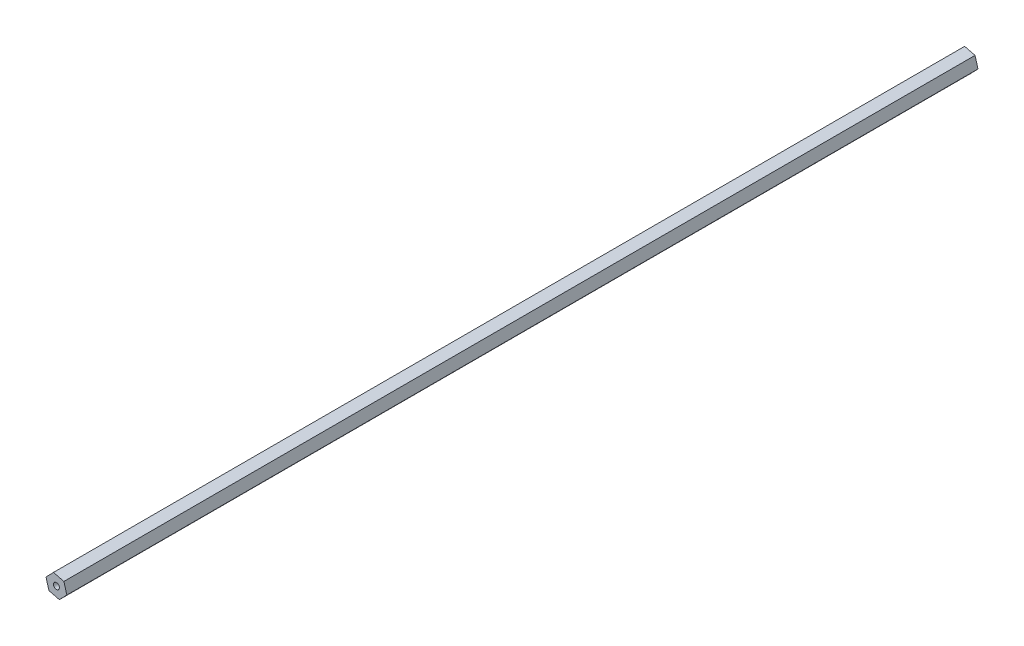
ISO-10303-21;
HEADER;
FILE_DESCRIPTION(('STEP AP214'),'2;1');
FILE_NAME('part.step','',(''),(''),'','','');
FILE_SCHEMA(('AUTOMOTIVE_DESIGN { 1 0 10303 214 1 1 1 1 }'));
ENDSEC;
DATA;
#1=APPLICATION_CONTEXT('core data for automotive mechanical design processes');
#2=APPLICATION_PROTOCOL_DEFINITION('international standard','automotive_design',2000,#1);
#3=PRODUCT_CONTEXT('',#1,'mechanical');
#4=PRODUCT('Part','Part','',(#3));
#5=PRODUCT_RELATED_PRODUCT_CATEGORY('part','',(#4));
#6=PRODUCT_DEFINITION_FORMATION('','',#4);
#7=PRODUCT_DEFINITION_CONTEXT('part definition',#1,'design');
#8=PRODUCT_DEFINITION('design','',#6,#7);
#9=PRODUCT_DEFINITION_SHAPE('','',#8);
#10=(LENGTH_UNIT() NAMED_UNIT(*) SI_UNIT(.MILLI.,.METRE.));
#11=(NAMED_UNIT(*) PLANE_ANGLE_UNIT() SI_UNIT($,.RADIAN.));
#12=(NAMED_UNIT(*) SI_UNIT($,.STERADIAN.) SOLID_ANGLE_UNIT());
#13=UNCERTAINTY_MEASURE_WITH_UNIT(LENGTH_MEASURE(1.E-05),#10,'distance_accuracy_value','');
#14=(GEOMETRIC_REPRESENTATION_CONTEXT(3) GLOBAL_UNCERTAINTY_ASSIGNED_CONTEXT((#13)) GLOBAL_UNIT_ASSIGNED_CONTEXT((#10,
#11,#12)) REPRESENTATION_CONTEXT('',''));
#15=CARTESIAN_POINT('',(0.,0.,0.));
#16=DIRECTION('',(0.,0.,1.));
#17=DIRECTION('',(1.,0.,0.));
#18=AXIS2_PLACEMENT_3D('',#15,#16,#17);
#19=CARTESIAN_POINT('',(-2.01661019445048,7.04958272928063,622.046));
#20=DIRECTION('',(0.718900237898645,-0.695113262676862,0.));
#21=DIRECTION('',(0.695113262676862,0.718900237898645,0.));
#22=AXIS2_PLACEMENT_3D('',#19,#20,#21);
#23=PLANE('',#22);
#24=DIRECTION('',(-0.695113262676862,-0.718900237898645,0.));
#25=VECTOR('',#24,1.);
#26=CARTESIAN_POINT('',(-2.01661019445048,7.04958272928063,0.));
#27=LINE('',#26,#25);
#28=CARTESIAN_POINT('',(-2.01661019445048,7.04958272928063,0.));
#29=VERTEX_POINT('',#28);
#30=CARTESIAN_POINT('',(-7.1134228268623,1.77835570671552,0.));
#31=VERTEX_POINT('',#30);
#32=EDGE_CURVE('E119',#29,#31,#27,.T.);
#33=ORIENTED_EDGE('',*,*,#32,.T.);
#34=DIRECTION('',(0.,0.,-1.));
#35=VECTOR('',#34,1.);
#36=CARTESIAN_POINT('',(-7.1134228268623,1.77835570671552,622.046));
#37=LINE('',#36,#35);
#38=CARTESIAN_POINT('',(-7.1134228268623,1.77835570671552,622.046));
#39=VERTEX_POINT('',#38);
#40=EDGE_CURVE('E11',#39,#31,#37,.T.);
#41=ORIENTED_EDGE('',*,*,#40,.F.);
#42=DIRECTION('',(-0.695113262676862,-0.718900237898645,0.));
#43=VECTOR('',#42,1.);
#44=CARTESIAN_POINT('',(-2.01661019445048,7.04958272928063,622.046));
#45=LINE('',#44,#43);
#46=CARTESIAN_POINT('',(-2.01661019445048,7.04958272928063,622.046));
#47=VERTEX_POINT('',#46);
#48=EDGE_CURVE('E129',#47,#39,#45,.T.);
#49=ORIENTED_EDGE('',*,*,#48,.F.);
#50=DIRECTION('',(0.,0.,-1.));
#51=VECTOR('',#50,1.);
#52=CARTESIAN_POINT('',(-2.01661019445048,7.04958272928063,622.046));
#53=LINE('',#52,#51);
#54=EDGE_CURVE('E115',#47,#29,#53,.T.);
#55=ORIENTED_EDGE('',*,*,#54,.T.);
#56=EDGE_LOOP('',(#33,#41,#49,#55));
#57=FACE_BOUND('',#56,.T.);
#58=ADVANCED_FACE('F34',(#57),#23,.F.);
#59=CARTESIAN_POINT('',(-7.1134228268623,1.77835570671552,622.046));
#60=DIRECTION('',(0.96143586293497,0.275029237468472,0.));
#61=DIRECTION('',(-0.275029237468472,0.96143586293497,0.));
#62=AXIS2_PLACEMENT_3D('',#59,#60,#61);
#63=PLANE('',#62);
#64=DIRECTION('',(0.275029237468472,-0.96143586293497,0.));
#65=VECTOR('',#64,1.);
#66=CARTESIAN_POINT('',(-7.1134228268623,1.77835570671552,0.));
#67=LINE('',#66,#65);
#68=CARTESIAN_POINT('',(-5.09681263241182,-5.27122702256511,0.));
#69=VERTEX_POINT('',#68);
#70=EDGE_CURVE('E122',#31,#69,#67,.T.);
#71=ORIENTED_EDGE('',*,*,#70,.T.);
#72=DIRECTION('',(0.,0.,-1.));
#73=VECTOR('',#72,1.);
#74=CARTESIAN_POINT('',(-5.09681263241182,-5.27122702256511,622.046));
#75=LINE('',#74,#73);
#76=CARTESIAN_POINT('',(-5.09681263241182,-5.27122702256511,622.046));
#77=VERTEX_POINT('',#76);
#78=EDGE_CURVE('E43',#77,#69,#75,.T.);
#79=ORIENTED_EDGE('',*,*,#78,.F.);
#80=DIRECTION('',(0.275029237468472,-0.96143586293497,0.));
#81=VECTOR('',#80,1.);
#82=CARTESIAN_POINT('',(-7.1134228268623,1.77835570671552,622.046));
#83=LINE('',#82,#81);
#84=EDGE_CURVE('E88',#39,#77,#83,.T.);
#85=ORIENTED_EDGE('',*,*,#84,.F.);
#86=ORIENTED_EDGE('',*,*,#40,.T.);
#87=EDGE_LOOP('',(#71,#79,#85,#86));
#88=FACE_BOUND('',#87,.T.);
#89=ADVANCED_FACE('F155',(#88),#63,.F.);
#90=CARTESIAN_POINT('',(-5.09681263241182,-5.27122702256511,622.046));
#91=DIRECTION('',(0.242535625036325,0.970142500145334,0.));
#92=DIRECTION('',(-0.970142500145334,0.242535625036325,0.));
#93=AXIS2_PLACEMENT_3D('',#90,#91,#92);
#94=PLANE('',#93);
#95=DIRECTION('',(0.970142500145334,-0.242535625036325,0.));
#96=VECTOR('',#95,1.);
#97=CARTESIAN_POINT('',(-5.09681263241182,-5.27122702256511,0.));
#98=LINE('',#97,#96);
#99=CARTESIAN_POINT('',(2.01661019445049,-7.04958272928063,0.));
#100=VERTEX_POINT('',#99);
#101=EDGE_CURVE('E124',#69,#100,#98,.T.);
#102=ORIENTED_EDGE('',*,*,#101,.T.);
#103=DIRECTION('',(0.,0.,-1.));
#104=VECTOR('',#103,1.);
#105=CARTESIAN_POINT('',(2.01661019445049,-7.04958272928063,622.046));
#106=LINE('',#105,#104);
#107=CARTESIAN_POINT('',(2.01661019445049,-7.04958272928063,622.046));
#108=VERTEX_POINT('',#107);
#109=EDGE_CURVE('E110',#108,#100,#106,.T.);
#110=ORIENTED_EDGE('',*,*,#109,.F.);
#111=DIRECTION('',(0.970142500145334,-0.242535625036325,0.));
#112=VECTOR('',#111,1.);
#113=CARTESIAN_POINT('',(-5.09681263241182,-5.27122702256511,622.046));
#114=LINE('',#113,#112);
#115=EDGE_CURVE('E101',#77,#108,#114,.T.);
#116=ORIENTED_EDGE('',*,*,#115,.F.);
#117=ORIENTED_EDGE('',*,*,#78,.T.);
#118=EDGE_LOOP('',(#102,#110,#116,#117));
#119=FACE_BOUND('',#118,.T.);
#120=ADVANCED_FACE('F136',(#119),#94,.F.);
#121=CARTESIAN_POINT('',(2.01661019445049,-7.04958272928063,622.046));
#122=DIRECTION('',(-0.718900237898645,0.695113262676862,0.));
#123=DIRECTION('',(-0.695113262676862,-0.718900237898645,0.));
#124=AXIS2_PLACEMENT_3D('',#121,#122,#123);
#125=PLANE('',#124);
#126=DIRECTION('',(0.695113262676862,0.718900237898645,0.));
#127=VECTOR('',#126,1.);
#128=CARTESIAN_POINT('',(2.01661019445049,-7.04958272928063,0.));
#129=LINE('',#128,#127);
#130=CARTESIAN_POINT('',(7.1134228268623,-1.77835570671552,0.));
#131=VERTEX_POINT('',#130);
#132=EDGE_CURVE('E109',#100,#131,#129,.T.);
#133=ORIENTED_EDGE('',*,*,#132,.T.);
#134=DIRECTION('',(0.,0.,-1.));
#135=VECTOR('',#134,1.);
#136=CARTESIAN_POINT('',(7.1134228268623,-1.77835570671552,622.046));
#137=LINE('',#136,#135);
#138=CARTESIAN_POINT('',(7.1134228268623,-1.77835570671552,622.046));
#139=VERTEX_POINT('',#138);
#140=EDGE_CURVE('E106',#139,#131,#137,.T.);
#141=ORIENTED_EDGE('',*,*,#140,.F.);
#142=DIRECTION('',(0.695113262676862,0.718900237898645,0.));
#143=VECTOR('',#142,1.);
#144=CARTESIAN_POINT('',(2.01661019445049,-7.04958272928063,622.046));
#145=LINE('',#144,#143);
#146=EDGE_CURVE('E95',#108,#139,#145,.T.);
#147=ORIENTED_EDGE('',*,*,#146,.F.);
#148=ORIENTED_EDGE('',*,*,#109,.T.);
#149=EDGE_LOOP('',(#133,#141,#147,#148));
#150=FACE_BOUND('',#149,.T.);
#151=ADVANCED_FACE('F107',(#150),#125,.F.);
#152=CARTESIAN_POINT('',(7.1134228268623,-1.77835570671552,622.046));
#153=DIRECTION('',(-0.96143586293497,-0.275029237468472,0.));
#154=DIRECTION('',(0.275029237468472,-0.96143586293497,0.));
#155=AXIS2_PLACEMENT_3D('',#152,#153,#154);
#156=PLANE('',#155);
#157=DIRECTION('',(-0.275029237468472,0.96143586293497,0.));
#158=VECTOR('',#157,1.);
#159=CARTESIAN_POINT('',(7.1134228268623,-1.77835570671552,0.));
#160=LINE('',#159,#158);
#161=CARTESIAN_POINT('',(5.09681263241182,5.27122702256512,0.));
#162=VERTEX_POINT('',#161);
#163=EDGE_CURVE('E74',#131,#162,#160,.T.);
#164=ORIENTED_EDGE('',*,*,#163,.T.);
#165=DIRECTION('',(0.,0.,-1.));
#166=VECTOR('',#165,1.);
#167=CARTESIAN_POINT('',(5.09681263241182,5.27122702256512,622.046));
#168=LINE('',#167,#166);
#169=CARTESIAN_POINT('',(5.09681263241182,5.27122702256512,622.046));
#170=VERTEX_POINT('',#169);
#171=EDGE_CURVE('E111',#170,#162,#168,.T.);
#172=ORIENTED_EDGE('',*,*,#171,.F.);
#173=DIRECTION('',(-0.275029237468472,0.96143586293497,0.));
#174=VECTOR('',#173,1.);
#175=CARTESIAN_POINT('',(7.1134228268623,-1.77835570671552,622.046));
#176=LINE('',#175,#174);
#177=EDGE_CURVE('E99',#139,#170,#176,.T.);
#178=ORIENTED_EDGE('',*,*,#177,.F.);
#179=ORIENTED_EDGE('',*,*,#140,.T.);
#180=EDGE_LOOP('',(#164,#172,#178,#179));
#181=FACE_BOUND('',#180,.T.);
#182=ADVANCED_FACE('F113',(#181),#156,.F.);
#183=CARTESIAN_POINT('',(5.09681263241182,5.27122702256512,622.046));
#184=DIRECTION('',(-0.242535625036325,-0.970142500145334,0.));
#185=DIRECTION('',(0.970142500145334,-0.242535625036325,0.));
#186=AXIS2_PLACEMENT_3D('',#183,#184,#185);
#187=PLANE('',#186);
#188=DIRECTION('',(-0.970142500145334,0.242535625036325,0.));
#189=VECTOR('',#188,1.);
#190=CARTESIAN_POINT('',(5.09681263241182,5.27122702256512,0.));
#191=LINE('',#190,#189);
#192=EDGE_CURVE('E80',#162,#29,#191,.T.);
#193=ORIENTED_EDGE('',*,*,#192,.T.);
#194=ORIENTED_EDGE('',*,*,#54,.F.);
#195=DIRECTION('',(-0.970142500145334,0.242535625036325,0.));
#196=VECTOR('',#195,1.);
#197=CARTESIAN_POINT('',(5.09681263241182,5.27122702256512,622.046));
#198=LINE('',#197,#196);
#199=EDGE_CURVE('E51',#170,#47,#198,.T.);
#200=ORIENTED_EDGE('',*,*,#199,.F.);
#201=ORIENTED_EDGE('',*,*,#171,.T.);
#202=EDGE_LOOP('',(#193,#194,#200,#201));
#203=FACE_BOUND('',#202,.T.);
#204=ADVANCED_FACE('F143',(#203),#187,.F.);
#205=CARTESIAN_POINT('',(0.,0.,622.046));
#206=DIRECTION('',(0.,0.,1.));
#207=DIRECTION('',(1.,0.,0.));
#208=AXIS2_PLACEMENT_3D('',#205,#206,#207);
#209=PLANE('',#208);
#210=CARTESIAN_POINT('',(0.,0.,622.046));
#211=DIRECTION('',(0.,0.,1.));
#212=DIRECTION('',(1.,0.,0.));
#213=AXIS2_PLACEMENT_3D('',#210,#211,#212);
#214=CIRCLE('',#213,2.032);
#215=CARTESIAN_POINT('',(2.032,0.,622.046));
#216=VERTEX_POINT('',#215);
#217=EDGE_CURVE('E208',#216,#216,#214,.T.);
#218=ORIENTED_EDGE('',*,*,#217,.F.);
#219=EDGE_LOOP('',(#218));
#220=FACE_BOUND('',#219,.T.);
#221=ORIENTED_EDGE('',*,*,#48,.T.);
#222=ORIENTED_EDGE('',*,*,#84,.T.);
#223=ORIENTED_EDGE('',*,*,#115,.T.);
#224=ORIENTED_EDGE('',*,*,#146,.T.);
#225=ORIENTED_EDGE('',*,*,#177,.T.);
#226=ORIENTED_EDGE('',*,*,#199,.T.);
#227=EDGE_LOOP('',(#221,#222,#223,#224,#225,#226));
#228=FACE_BOUND('',#227,.T.);
#229=ADVANCED_FACE('F97',(#220,#228),#209,.T.);
#230=CARTESIAN_POINT('',(0.,0.,0.));
#231=DIRECTION('',(0.,0.,1.));
#232=DIRECTION('',(1.,0.,0.));
#233=AXIS2_PLACEMENT_3D('',#230,#231,#232);
#234=PLANE('',#233);
#235=CARTESIAN_POINT('',(0.,0.,0.));
#236=DIRECTION('',(0.,0.,1.));
#237=DIRECTION('',(1.,0.,0.));
#238=AXIS2_PLACEMENT_3D('',#235,#236,#237);
#239=CIRCLE('',#238,2.032);
#240=CARTESIAN_POINT('',(2.032,0.,0.));
#241=VERTEX_POINT('',#240);
#242=EDGE_CURVE('E37',#241,#241,#239,.T.);
#243=ORIENTED_EDGE('',*,*,#242,.T.);
#244=EDGE_LOOP('',(#243));
#245=FACE_BOUND('',#244,.T.);
#246=ORIENTED_EDGE('',*,*,#32,.F.);
#247=ORIENTED_EDGE('',*,*,#192,.F.);
#248=ORIENTED_EDGE('',*,*,#163,.F.);
#249=ORIENTED_EDGE('',*,*,#132,.F.);
#250=ORIENTED_EDGE('',*,*,#101,.F.);
#251=ORIENTED_EDGE('',*,*,#70,.F.);
#252=EDGE_LOOP('',(#246,#247,#248,#249,#250,#251));
#253=FACE_BOUND('',#252,.T.);
#254=ADVANCED_FACE('F139',(#245,#253),#234,.F.);
#255=CARTESIAN_POINT('',(0.,0.,-114.554));
#256=DIRECTION('',(0.,0.,1.));
#257=DIRECTION('',(1.,0.,0.));
#258=AXIS2_PLACEMENT_3D('',#255,#256,#257);
#259=CYLINDRICAL_SURFACE('',#258,2.032);
#260=ORIENTED_EDGE('',*,*,#217,.T.);
#261=EDGE_LOOP('',(#260));
#262=FACE_BOUND('',#261,.T.);
#263=ORIENTED_EDGE('',*,*,#242,.F.);
#264=EDGE_LOOP('',(#263));
#265=FACE_BOUND('',#264,.T.);
#266=ADVANCED_FACE('F192',(#262,#265),#259,.F.);
#267=CLOSED_SHELL('',(#58,#89,#120,#151,#182,#204,#229,#254,#266));
#268=MANIFOLD_SOLID_BREP('B2',#267);
#269=ADVANCED_BREP_SHAPE_REPRESENTATION('',(#18,#268),#14);
#270=SHAPE_DEFINITION_REPRESENTATION(#9,#269);
ENDSEC;
END-ISO-10303-21;
